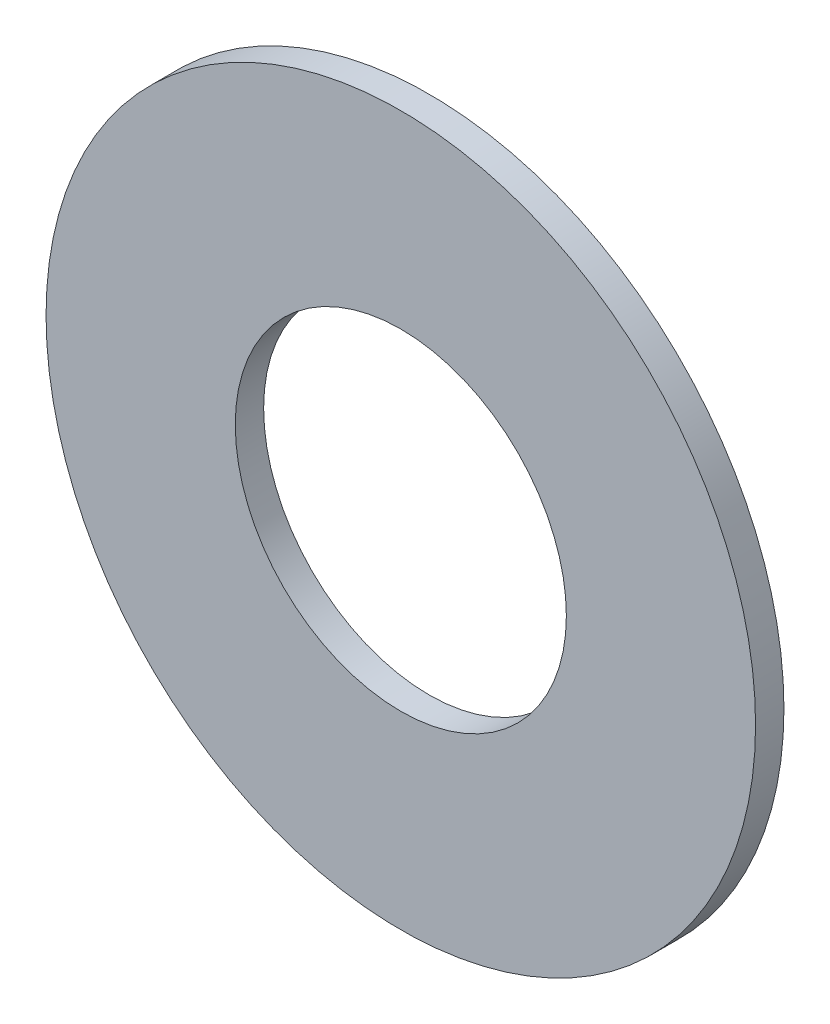
ISO-10303-21;
HEADER;
FILE_DESCRIPTION(('STEP AP214'),'2;1');
FILE_NAME('part.step','',(''),(''),'','','');
FILE_SCHEMA(('AUTOMOTIVE_DESIGN { 1 0 10303 214 1 1 1 1 }'));
ENDSEC;
DATA;
#1=APPLICATION_CONTEXT('core data for automotive mechanical design processes');
#2=APPLICATION_PROTOCOL_DEFINITION('international standard','automotive_design',2000,#1);
#3=PRODUCT_CONTEXT('',#1,'mechanical');
#4=PRODUCT('Part','Part','',(#3));
#5=PRODUCT_RELATED_PRODUCT_CATEGORY('part','',(#4));
#6=PRODUCT_DEFINITION_FORMATION('','',#4);
#7=PRODUCT_DEFINITION_CONTEXT('part definition',#1,'design');
#8=PRODUCT_DEFINITION('design','',#6,#7);
#9=PRODUCT_DEFINITION_SHAPE('','',#8);
#10=(LENGTH_UNIT() NAMED_UNIT(*) SI_UNIT(.MILLI.,.METRE.));
#11=(NAMED_UNIT(*) PLANE_ANGLE_UNIT() SI_UNIT($,.RADIAN.));
#12=(NAMED_UNIT(*) SI_UNIT($,.STERADIAN.) SOLID_ANGLE_UNIT());
#13=UNCERTAINTY_MEASURE_WITH_UNIT(LENGTH_MEASURE(1.E-05),#10,'distance_accuracy_value','');
#14=(GEOMETRIC_REPRESENTATION_CONTEXT(3) GLOBAL_UNCERTAINTY_ASSIGNED_CONTEXT((#13)) GLOBAL_UNIT_ASSIGNED_CONTEXT((#10,
#11,#12)) REPRESENTATION_CONTEXT('',''));
#15=CARTESIAN_POINT('',(0.,0.,0.));
#16=DIRECTION('',(0.,0.,1.));
#17=DIRECTION('',(1.,0.,0.));
#18=AXIS2_PLACEMENT_3D('',#15,#16,#17);
#19=CARTESIAN_POINT('',(0.,0.,3.));
#20=DIRECTION('',(0.,0.,1.));
#21=DIRECTION('',(1.,0.,0.));
#22=AXIS2_PLACEMENT_3D('',#19,#20,#21);
#23=PLANE('',#22);
#24=CARTESIAN_POINT('',(0.,0.,3.));
#25=DIRECTION('',(0.,0.,1.));
#26=DIRECTION('',(1.,0.,0.));
#27=AXIS2_PLACEMENT_3D('',#24,#25,#26);
#28=CIRCLE('',#27,37.5);
#29=CARTESIAN_POINT('',(37.5,0.,3.));
#30=VERTEX_POINT('',#29);
#31=EDGE_CURVE('E10',#30,#30,#28,.T.);
#32=ORIENTED_EDGE('',*,*,#31,.T.);
#33=EDGE_LOOP('',(#32));
#34=FACE_BOUND('',#33,.T.);
#35=CARTESIAN_POINT('',(0.,0.,3.));
#36=DIRECTION('',(0.,0.,1.));
#37=DIRECTION('',(1.,0.,0.));
#38=AXIS2_PLACEMENT_3D('',#35,#36,#37);
#39=CIRCLE('',#38,17.5);
#40=CARTESIAN_POINT('',(17.5,0.,3.));
#41=VERTEX_POINT('',#40);
#42=EDGE_CURVE('E45',#41,#41,#39,.T.);
#43=ORIENTED_EDGE('',*,*,#42,.F.);
#44=EDGE_LOOP('',(#43));
#45=FACE_BOUND('',#44,.T.);
#46=ADVANCED_FACE('F34',(#34,#45),#23,.T.);
#47=CARTESIAN_POINT('',(0.,0.,0.));
#48=DIRECTION('',(0.,0.,1.));
#49=DIRECTION('',(1.,0.,0.));
#50=AXIS2_PLACEMENT_3D('',#47,#48,#49);
#51=PLANE('',#50);
#52=CARTESIAN_POINT('',(0.,0.,0.));
#53=DIRECTION('',(0.,0.,1.));
#54=DIRECTION('',(1.,0.,0.));
#55=AXIS2_PLACEMENT_3D('',#52,#53,#54);
#56=CIRCLE('',#55,37.5);
#57=CARTESIAN_POINT('',(37.5,0.,0.));
#58=VERTEX_POINT('',#57);
#59=EDGE_CURVE('E38',#58,#58,#56,.T.);
#60=ORIENTED_EDGE('',*,*,#59,.F.);
#61=EDGE_LOOP('',(#60));
#62=FACE_BOUND('',#61,.T.);
#63=CARTESIAN_POINT('',(0.,0.,0.));
#64=DIRECTION('',(0.,0.,1.));
#65=DIRECTION('',(1.,0.,0.));
#66=AXIS2_PLACEMENT_3D('',#63,#64,#65);
#67=CIRCLE('',#66,17.5);
#68=CARTESIAN_POINT('',(17.5,0.,0.));
#69=VERTEX_POINT('',#68);
#70=EDGE_CURVE('E47',#69,#69,#67,.T.);
#71=ORIENTED_EDGE('',*,*,#70,.T.);
#72=EDGE_LOOP('',(#71));
#73=FACE_BOUND('',#72,.T.);
#74=ADVANCED_FACE('F57',(#62,#73),#51,.F.);
#75=CARTESIAN_POINT('',(0.,0.,3.));
#76=DIRECTION('',(0.,0.,-1.));
#77=DIRECTION('',(-1.,0.,0.));
#78=AXIS2_PLACEMENT_3D('',#75,#76,#77);
#79=CYLINDRICAL_SURFACE('',#78,37.5);
#80=ORIENTED_EDGE('',*,*,#31,.F.);
#81=EDGE_LOOP('',(#80));
#82=FACE_BOUND('',#81,.T.);
#83=ORIENTED_EDGE('',*,*,#59,.T.);
#84=EDGE_LOOP('',(#83));
#85=FACE_BOUND('',#84,.T.);
#86=ADVANCED_FACE('F36',(#82,#85),#79,.T.);
#87=CARTESIAN_POINT('',(0.,0.,3.));
#88=DIRECTION('',(0.,0.,-1.));
#89=DIRECTION('',(-1.,0.,0.));
#90=AXIS2_PLACEMENT_3D('',#87,#88,#89);
#91=CYLINDRICAL_SURFACE('',#90,17.5);
#92=ORIENTED_EDGE('',*,*,#42,.T.);
#93=EDGE_LOOP('',(#92));
#94=FACE_BOUND('',#93,.T.);
#95=ORIENTED_EDGE('',*,*,#70,.F.);
#96=EDGE_LOOP('',(#95));
#97=FACE_BOUND('',#96,.T.);
#98=ADVANCED_FACE('F53',(#94,#97),#91,.F.);
#99=CLOSED_SHELL('',(#46,#74,#86,#98));
#100=MANIFOLD_SOLID_BREP('B2',#99);
#101=ADVANCED_BREP_SHAPE_REPRESENTATION('',(#18,#100),#14);
#102=SHAPE_DEFINITION_REPRESENTATION(#9,#101);
ENDSEC;
END-ISO-10303-21;
